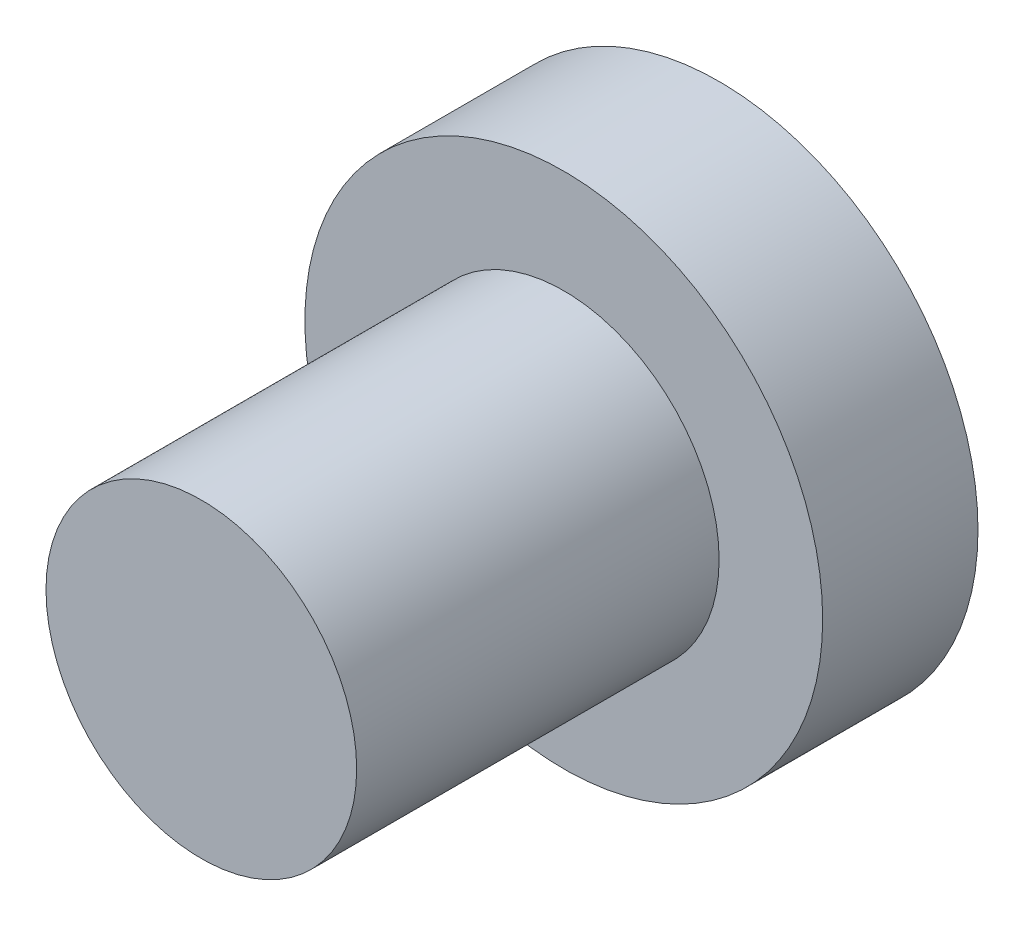
ISO-10303-21;
HEADER;
FILE_DESCRIPTION(('STEP AP214'),'2;1');
FILE_NAME('part.step','',(''),(''),'','','');
FILE_SCHEMA(('AUTOMOTIVE_DESIGN { 1 0 10303 214 1 1 1 1 }'));
ENDSEC;
DATA;
#1=APPLICATION_CONTEXT('core data for automotive mechanical design processes');
#2=APPLICATION_PROTOCOL_DEFINITION('international standard','automotive_design',2000,#1);
#3=PRODUCT_CONTEXT('',#1,'mechanical');
#4=PRODUCT('Part','Part','',(#3));
#5=PRODUCT_RELATED_PRODUCT_CATEGORY('part','',(#4));
#6=PRODUCT_DEFINITION_FORMATION('','',#4);
#7=PRODUCT_DEFINITION_CONTEXT('part definition',#1,'design');
#8=PRODUCT_DEFINITION('design','',#6,#7);
#9=PRODUCT_DEFINITION_SHAPE('','',#8);
#10=(LENGTH_UNIT() NAMED_UNIT(*) SI_UNIT(.MILLI.,.METRE.));
#11=(NAMED_UNIT(*) PLANE_ANGLE_UNIT() SI_UNIT($,.RADIAN.));
#12=(NAMED_UNIT(*) SI_UNIT($,.STERADIAN.) SOLID_ANGLE_UNIT());
#13=UNCERTAINTY_MEASURE_WITH_UNIT(LENGTH_MEASURE(1.E-05),#10,'distance_accuracy_value','');
#14=(GEOMETRIC_REPRESENTATION_CONTEXT(3) GLOBAL_UNCERTAINTY_ASSIGNED_CONTEXT((#13)) GLOBAL_UNIT_ASSIGNED_CONTEXT((#10,
#11,#12)) REPRESENTATION_CONTEXT('',''));
#15=CARTESIAN_POINT('',(0.,0.,0.));
#16=DIRECTION('',(0.,0.,1.));
#17=DIRECTION('',(1.,0.,0.));
#18=AXIS2_PLACEMENT_3D('',#15,#16,#17);
#19=CARTESIAN_POINT('',(0.,0.,3.));
#20=DIRECTION('',(0.,0.,1.));
#21=DIRECTION('',(1.,0.,0.));
#22=AXIS2_PLACEMENT_3D('',#19,#20,#21);
#23=PLANE('',#22);
#24=CARTESIAN_POINT('',(0.,0.,3.));
#25=DIRECTION('',(0.,0.,1.));
#26=DIRECTION('',(1.,0.,0.));
#27=AXIS2_PLACEMENT_3D('',#24,#25,#26);
#28=CIRCLE('',#27,5.);
#29=CARTESIAN_POINT('',(5.,0.,3.));
#30=VERTEX_POINT('',#29);
#31=EDGE_CURVE('E12',#30,#30,#28,.T.);
#32=ORIENTED_EDGE('',*,*,#31,.T.);
#33=EDGE_LOOP('',(#32));
#34=FACE_BOUND('',#33,.T.);
#35=CARTESIAN_POINT('',(0.,0.,3.));
#36=DIRECTION('',(0.,0.,1.));
#37=DIRECTION('',(1.,0.,0.));
#38=AXIS2_PLACEMENT_3D('',#35,#36,#37);
#39=CIRCLE('',#38,3.);
#40=CARTESIAN_POINT('',(3.,0.,3.));
#41=VERTEX_POINT('',#40);
#42=EDGE_CURVE('E55',#41,#41,#39,.T.);
#43=ORIENTED_EDGE('',*,*,#42,.F.);
#44=EDGE_LOOP('',(#43));
#45=FACE_BOUND('',#44,.T.);
#46=ADVANCED_FACE('F42',(#34,#45),#23,.T.);
#47=CARTESIAN_POINT('',(0.,0.,3.));
#48=DIRECTION('',(0.,0.,-1.));
#49=DIRECTION('',(-1.,0.,0.));
#50=AXIS2_PLACEMENT_3D('',#47,#48,#49);
#51=CYLINDRICAL_SURFACE('',#50,5.);
#52=ORIENTED_EDGE('',*,*,#31,.F.);
#53=EDGE_LOOP('',(#52));
#54=FACE_BOUND('',#53,.T.);
#55=CARTESIAN_POINT('',(0.,0.,0.));
#56=DIRECTION('',(0.,0.,1.));
#57=DIRECTION('',(1.,0.,0.));
#58=AXIS2_PLACEMENT_3D('',#55,#56,#57);
#59=CIRCLE('',#58,5.);
#60=CARTESIAN_POINT('',(5.,0.,0.));
#61=VERTEX_POINT('',#60);
#62=EDGE_CURVE('E46',#61,#61,#59,.T.);
#63=ORIENTED_EDGE('',*,*,#62,.T.);
#64=EDGE_LOOP('',(#63));
#65=FACE_BOUND('',#64,.T.);
#66=ADVANCED_FACE('F44',(#54,#65),#51,.T.);
#67=CARTESIAN_POINT('',(0.,0.,0.));
#68=DIRECTION('',(0.,0.,1.));
#69=DIRECTION('',(1.,0.,0.));
#70=AXIS2_PLACEMENT_3D('',#67,#68,#69);
#71=PLANE('',#70);
#72=ORIENTED_EDGE('',*,*,#62,.F.);
#73=EDGE_LOOP('',(#72));
#74=FACE_BOUND('',#73,.T.);
#75=ADVANCED_FACE('F66',(#74),#71,.F.);
#76=CARTESIAN_POINT('',(0.,0.,10.));
#77=DIRECTION('',(0.,0.,-1.));
#78=DIRECTION('',(-1.,0.,0.));
#79=AXIS2_PLACEMENT_3D('',#76,#77,#78);
#80=CYLINDRICAL_SURFACE('',#79,3.);
#81=CARTESIAN_POINT('',(0.,0.,10.));
#82=DIRECTION('',(0.,0.,1.));
#83=DIRECTION('',(1.,0.,0.));
#84=AXIS2_PLACEMENT_3D('',#81,#82,#83);
#85=CIRCLE('',#84,3.);
#86=CARTESIAN_POINT('',(3.,0.,10.));
#87=VERTEX_POINT('',#86);
#88=EDGE_CURVE('E53',#87,#87,#85,.T.);
#89=ORIENTED_EDGE('',*,*,#88,.F.);
#90=EDGE_LOOP('',(#89));
#91=FACE_BOUND('',#90,.T.);
#92=ORIENTED_EDGE('',*,*,#42,.T.);
#93=EDGE_LOOP('',(#92));
#94=FACE_BOUND('',#93,.T.);
#95=ADVANCED_FACE('F63',(#91,#94),#80,.T.);
#96=CARTESIAN_POINT('',(0.,0.,10.));
#97=DIRECTION('',(0.,0.,1.));
#98=DIRECTION('',(1.,0.,0.));
#99=AXIS2_PLACEMENT_3D('',#96,#97,#98);
#100=PLANE('',#99);
#101=ORIENTED_EDGE('',*,*,#88,.T.);
#102=EDGE_LOOP('',(#101));
#103=FACE_BOUND('',#102,.T.);
#104=ADVANCED_FACE('F61',(#103),#100,.T.);
#105=CLOSED_SHELL('',(#46,#66,#75,#95,#104));
#106=MANIFOLD_SOLID_BREP('B2',#105);
#107=ADVANCED_BREP_SHAPE_REPRESENTATION('',(#18,#106),#14);
#108=SHAPE_DEFINITION_REPRESENTATION(#9,#107);
ENDSEC;
END-ISO-10303-21;
